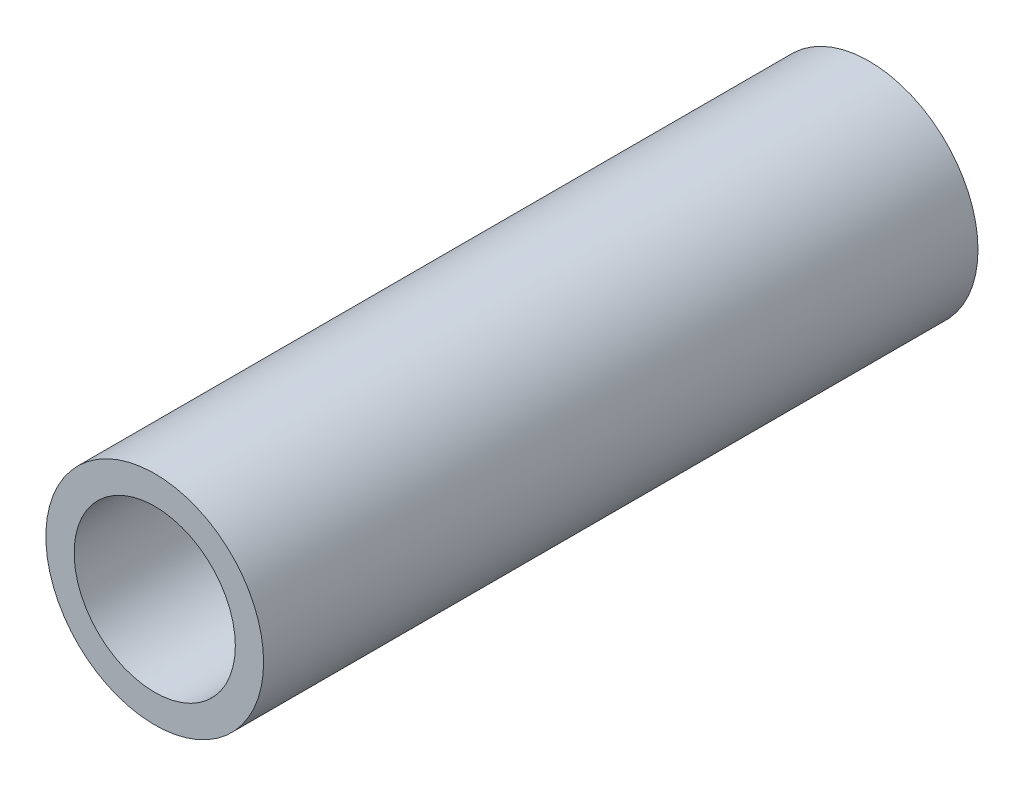
ISO-10303-21;
HEADER;
FILE_DESCRIPTION(('STEP AP214'),'2;1');
FILE_NAME('part.step','',(''),(''),'','','');
FILE_SCHEMA(('AUTOMOTIVE_DESIGN { 1 0 10303 214 1 1 1 1 }'));
ENDSEC;
DATA;
#1=APPLICATION_CONTEXT('core data for automotive mechanical design processes');
#2=APPLICATION_PROTOCOL_DEFINITION('international standard','automotive_design',2000,#1);
#3=PRODUCT_CONTEXT('',#1,'mechanical');
#4=PRODUCT('Part','Part','',(#3));
#5=PRODUCT_RELATED_PRODUCT_CATEGORY('part','',(#4));
#6=PRODUCT_DEFINITION_FORMATION('','',#4);
#7=PRODUCT_DEFINITION_CONTEXT('part definition',#1,'design');
#8=PRODUCT_DEFINITION('design','',#6,#7);
#9=PRODUCT_DEFINITION_SHAPE('','',#8);
#10=(LENGTH_UNIT() NAMED_UNIT(*) SI_UNIT(.MILLI.,.METRE.));
#11=(NAMED_UNIT(*) PLANE_ANGLE_UNIT() SI_UNIT($,.RADIAN.));
#12=(NAMED_UNIT(*) SI_UNIT($,.STERADIAN.) SOLID_ANGLE_UNIT());
#13=UNCERTAINTY_MEASURE_WITH_UNIT(LENGTH_MEASURE(1.E-05),#10,'distance_accuracy_value','');
#14=(GEOMETRIC_REPRESENTATION_CONTEXT(3) GLOBAL_UNCERTAINTY_ASSIGNED_CONTEXT((#13)) GLOBAL_UNIT_ASSIGNED_CONTEXT((#10,
#11,#12)) REPRESENTATION_CONTEXT('',''));
#15=CARTESIAN_POINT('',(0.,0.,0.));
#16=DIRECTION('',(0.,0.,1.));
#17=DIRECTION('',(1.,0.,0.));
#18=AXIS2_PLACEMENT_3D('',#15,#16,#17);
#19=CARTESIAN_POINT('',(0.,0.,35.));
#20=DIRECTION('',(0.,0.,1.));
#21=DIRECTION('',(1.,0.,0.));
#22=AXIS2_PLACEMENT_3D('',#19,#20,#21);
#23=PLANE('',#22);
#24=CARTESIAN_POINT('',(0.,0.,35.));
#25=DIRECTION('',(0.,0.,1.));
#26=DIRECTION('',(1.,0.,0.));
#27=AXIS2_PLACEMENT_3D('',#24,#25,#26);
#28=CIRCLE('',#27,10.668);
#29=CARTESIAN_POINT('',(10.668,0.,35.));
#30=VERTEX_POINT('',#29);
#31=EDGE_CURVE('E11',#30,#30,#28,.T.);
#32=ORIENTED_EDGE('',*,*,#31,.T.);
#33=EDGE_LOOP('',(#32));
#34=FACE_BOUND('',#33,.T.);
#35=CARTESIAN_POINT('',(0.,0.,35.));
#36=DIRECTION('',(0.,0.,1.));
#37=DIRECTION('',(1.,0.,0.));
#38=AXIS2_PLACEMENT_3D('',#35,#36,#37);
#39=CIRCLE('',#38,7.8994);
#40=CARTESIAN_POINT('',(7.8994,0.,35.));
#41=VERTEX_POINT('',#40);
#42=EDGE_CURVE('E48',#41,#41,#39,.T.);
#43=ORIENTED_EDGE('',*,*,#42,.F.);
#44=EDGE_LOOP('',(#43));
#45=FACE_BOUND('',#44,.T.);
#46=ADVANCED_FACE('F37',(#34,#45),#23,.T.);
#47=CARTESIAN_POINT('',(0.,0.,-35.));
#48=DIRECTION('',(0.,0.,1.));
#49=DIRECTION('',(1.,0.,0.));
#50=AXIS2_PLACEMENT_3D('',#47,#48,#49);
#51=PLANE('',#50);
#52=CARTESIAN_POINT('',(0.,0.,-35.));
#53=DIRECTION('',(0.,0.,1.));
#54=DIRECTION('',(1.,0.,0.));
#55=AXIS2_PLACEMENT_3D('',#52,#53,#54);
#56=CIRCLE('',#55,10.668);
#57=CARTESIAN_POINT('',(10.668,0.,-35.));
#58=VERTEX_POINT('',#57);
#59=EDGE_CURVE('E41',#58,#58,#56,.T.);
#60=ORIENTED_EDGE('',*,*,#59,.F.);
#61=EDGE_LOOP('',(#60));
#62=FACE_BOUND('',#61,.T.);
#63=CARTESIAN_POINT('',(0.,0.,-35.));
#64=DIRECTION('',(0.,0.,1.));
#65=DIRECTION('',(1.,0.,0.));
#66=AXIS2_PLACEMENT_3D('',#63,#64,#65);
#67=CIRCLE('',#66,7.8994);
#68=CARTESIAN_POINT('',(7.8994,0.,-35.));
#69=VERTEX_POINT('',#68);
#70=EDGE_CURVE('E50',#69,#69,#67,.T.);
#71=ORIENTED_EDGE('',*,*,#70,.T.);
#72=EDGE_LOOP('',(#71));
#73=FACE_BOUND('',#72,.T.);
#74=ADVANCED_FACE('F60',(#62,#73),#51,.F.);
#75=CARTESIAN_POINT('',(0.,0.,35.));
#76=DIRECTION('',(0.,0.,-1.));
#77=DIRECTION('',(-1.,0.,0.));
#78=AXIS2_PLACEMENT_3D('',#75,#76,#77);
#79=CYLINDRICAL_SURFACE('',#78,10.668);
#80=ORIENTED_EDGE('',*,*,#31,.F.);
#81=EDGE_LOOP('',(#80));
#82=FACE_BOUND('',#81,.T.);
#83=ORIENTED_EDGE('',*,*,#59,.T.);
#84=EDGE_LOOP('',(#83));
#85=FACE_BOUND('',#84,.T.);
#86=ADVANCED_FACE('F39',(#82,#85),#79,.T.);
#87=CARTESIAN_POINT('',(0.,0.,35.));
#88=DIRECTION('',(0.,0.,-1.));
#89=DIRECTION('',(-1.,0.,0.));
#90=AXIS2_PLACEMENT_3D('',#87,#88,#89);
#91=CYLINDRICAL_SURFACE('',#90,7.8994);
#92=ORIENTED_EDGE('',*,*,#42,.T.);
#93=EDGE_LOOP('',(#92));
#94=FACE_BOUND('',#93,.T.);
#95=ORIENTED_EDGE('',*,*,#70,.F.);
#96=EDGE_LOOP('',(#95));
#97=FACE_BOUND('',#96,.T.);
#98=ADVANCED_FACE('F56',(#94,#97),#91,.F.);
#99=CLOSED_SHELL('',(#46,#74,#86,#98));
#100=MANIFOLD_SOLID_BREP('B2',#99);
#101=ADVANCED_BREP_SHAPE_REPRESENTATION('',(#18,#100),#14);
#102=SHAPE_DEFINITION_REPRESENTATION(#9,#101);
ENDSEC;
END-ISO-10303-21;
